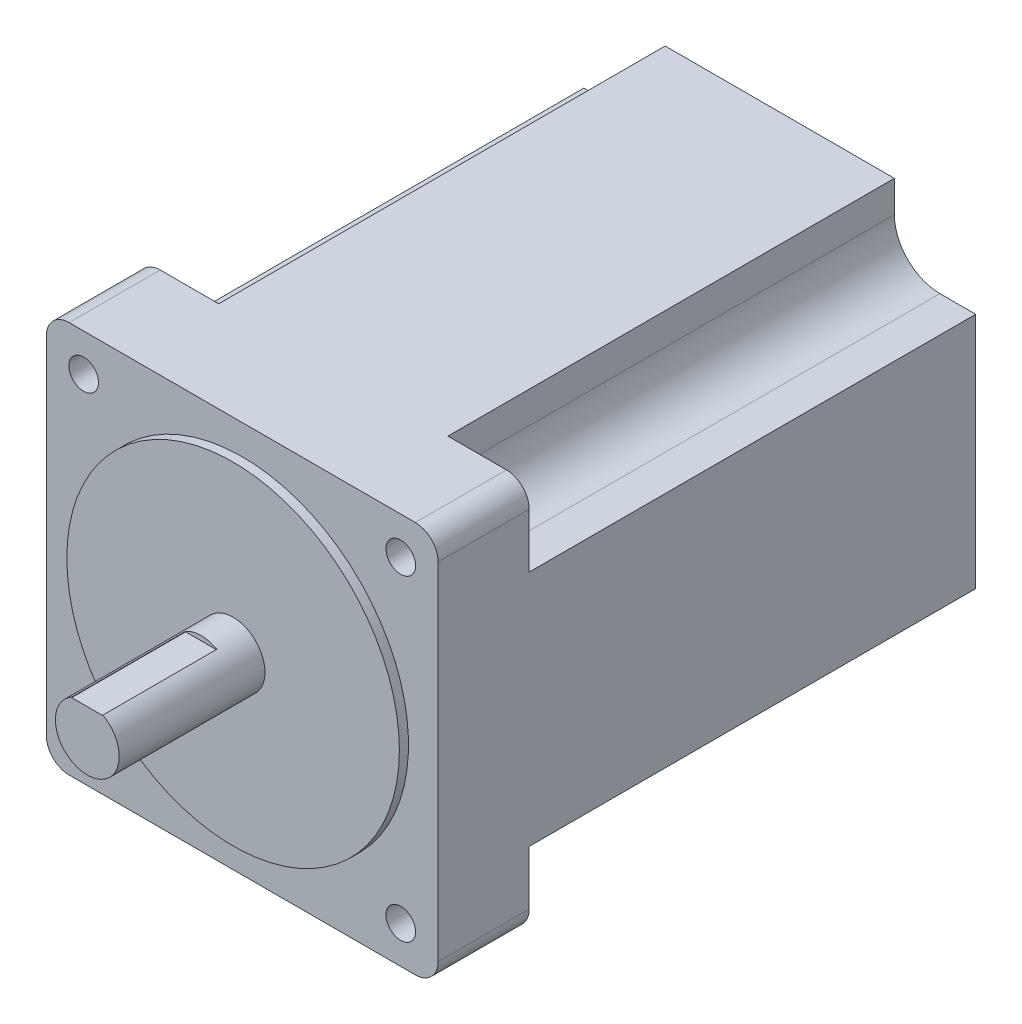
ISO-10303-21;
HEADER;
FILE_DESCRIPTION(('STEP AP214'),'2;1');
FILE_NAME('part.step','',(''),(''),'','','');
FILE_SCHEMA(('AUTOMOTIVE_DESIGN { 1 0 10303 214 1 1 1 1 }'));
ENDSEC;
DATA;
#1=APPLICATION_CONTEXT('core data for automotive mechanical design processes');
#2=APPLICATION_PROTOCOL_DEFINITION('international standard','automotive_design',2000,#1);
#3=PRODUCT_CONTEXT('',#1,'mechanical');
#4=PRODUCT('Part','Part','',(#3));
#5=PRODUCT_RELATED_PRODUCT_CATEGORY('part','',(#4));
#6=PRODUCT_DEFINITION_FORMATION('','',#4);
#7=PRODUCT_DEFINITION_CONTEXT('part definition',#1,'design');
#8=PRODUCT_DEFINITION('design','',#6,#7);
#9=PRODUCT_DEFINITION_SHAPE('','',#8);
#10=(LENGTH_UNIT() NAMED_UNIT(*) SI_UNIT(.MILLI.,.METRE.));
#11=(NAMED_UNIT(*) PLANE_ANGLE_UNIT() SI_UNIT($,.RADIAN.));
#12=(NAMED_UNIT(*) SI_UNIT($,.STERADIAN.) SOLID_ANGLE_UNIT());
#13=UNCERTAINTY_MEASURE_WITH_UNIT(LENGTH_MEASURE(1.E-05),#10,'distance_accuracy_value','');
#14=(GEOMETRIC_REPRESENTATION_CONTEXT(3) GLOBAL_UNCERTAINTY_ASSIGNED_CONTEXT((#13)) GLOBAL_UNIT_ASSIGNED_CONTEXT((#10,
#11,#12)) REPRESENTATION_CONTEXT('',''));
#15=CARTESIAN_POINT('',(0.,0.,0.));
#16=DIRECTION('',(0.,0.,1.));
#17=DIRECTION('',(1.,0.,0.));
#18=AXIS2_PLACEMENT_3D('',#15,#16,#17);
#19=CARTESIAN_POINT('',(5.,5.,118.));
#20=DIRECTION('',(0.,0.,-1.));
#21=DIRECTION('',(-1.,0.,0.));
#22=AXIS2_PLACEMENT_3D('',#19,#20,#21);
#23=CYLINDRICAL_SURFACE('',#22,5.);
#24=DIRECTION('',(0.,0.,-1.));
#25=VECTOR('',#24,1.);
#26=CARTESIAN_POINT('',(0.,5.,118.));
#27=LINE('',#26,#25);
#28=CARTESIAN_POINT('',(0.,5.,98.));
#29=VERTEX_POINT('',#28);
#30=CARTESIAN_POINT('',(0.,5.,118.));
#31=VERTEX_POINT('',#30);
#32=EDGE_CURVE('E446',#29,#31,#27,.F.);
#33=ORIENTED_EDGE('',*,*,#32,.F.);
#34=CARTESIAN_POINT('',(5.,5.,98.));
#35=DIRECTION('',(0.,0.,-1.));
#36=DIRECTION('',(-1.,0.,0.));
#37=AXIS2_PLACEMENT_3D('',#34,#35,#36);
#38=CIRCLE('',#37,5.);
#39=CARTESIAN_POINT('',(5.,0.,98.));
#40=VERTEX_POINT('',#39);
#41=EDGE_CURVE('E310',#29,#40,#38,.F.);
#42=ORIENTED_EDGE('',*,*,#41,.T.);
#43=DIRECTION('',(0.,0.,-1.));
#44=VECTOR('',#43,1.);
#45=CARTESIAN_POINT('',(5.,0.,118.));
#46=LINE('',#45,#44);
#47=CARTESIAN_POINT('',(5.,0.,118.));
#48=VERTEX_POINT('',#47);
#49=EDGE_CURVE('E430',#48,#40,#46,.T.);
#50=ORIENTED_EDGE('',*,*,#49,.F.);
#51=CARTESIAN_POINT('',(5.,5.,118.));
#52=DIRECTION('',(0.,0.,-1.));
#53=DIRECTION('',(-1.,0.,0.));
#54=AXIS2_PLACEMENT_3D('',#51,#52,#53);
#55=CIRCLE('',#54,5.);
#56=EDGE_CURVE('E439',#31,#48,#55,.F.);
#57=ORIENTED_EDGE('',*,*,#56,.F.);
#58=EDGE_LOOP('',(#33,#42,#50,#57));
#59=FACE_BOUND('',#58,.T.);
#60=ADVANCED_FACE('F35',(#59),#23,.T.);
#61=CARTESIAN_POINT('',(8.19999999999998,8.2,0.));
#62=DIRECTION('',(0.,0.,1.));
#63=DIRECTION('',(1.,0.,0.));
#64=AXIS2_PLACEMENT_3D('',#61,#62,#63);
#65=CYLINDRICAL_SURFACE('',#64,3.25);
#66=CARTESIAN_POINT('',(8.19999999999998,8.2,118.));
#67=DIRECTION('',(0.,0.,1.));
#68=DIRECTION('',(-1.,0.,0.));
#69=AXIS2_PLACEMENT_3D('',#66,#67,#68);
#70=CIRCLE('',#69,3.25);
#71=CARTESIAN_POINT('',(4.94999999999998,8.2,118.));
#72=VERTEX_POINT('',#71);
#73=EDGE_CURVE('E360',#72,#72,#70,.T.);
#74=ORIENTED_EDGE('',*,*,#73,.T.);
#75=EDGE_LOOP('',(#74));
#76=FACE_BOUND('',#75,.T.);
#77=CARTESIAN_POINT('',(8.19999999999998,8.2,98.));
#78=DIRECTION('',(0.,0.,-1.));
#79=DIRECTION('',(-1.,0.,0.));
#80=AXIS2_PLACEMENT_3D('',#77,#78,#79);
#81=CIRCLE('',#80,3.25);
#82=CARTESIAN_POINT('',(4.94999999999998,8.2,98.));
#83=VERTEX_POINT('',#82);
#84=EDGE_CURVE('E309',#83,#83,#81,.F.);
#85=ORIENTED_EDGE('',*,*,#84,.F.);
#86=EDGE_LOOP('',(#85));
#87=FACE_BOUND('',#86,.T.);
#88=ADVANCED_FACE('F466',(#76,#87),#65,.F.);
#89=CARTESIAN_POINT('',(81.,81.,118.));
#90=DIRECTION('',(0.,0.,-1.));
#91=DIRECTION('',(-1.,0.,0.));
#92=AXIS2_PLACEMENT_3D('',#89,#90,#91);
#93=CYLINDRICAL_SURFACE('',#92,5.);
#94=DIRECTION('',(0.,0.,-1.));
#95=VECTOR('',#94,1.);
#96=CARTESIAN_POINT('',(86.,81.,118.));
#97=LINE('',#96,#95);
#98=CARTESIAN_POINT('',(86.,81.,98.));
#99=VERTEX_POINT('',#98);
#100=CARTESIAN_POINT('',(86.,81.,118.));
#101=VERTEX_POINT('',#100);
#102=EDGE_CURVE('E417',#99,#101,#97,.F.);
#103=ORIENTED_EDGE('',*,*,#102,.F.);
#104=CARTESIAN_POINT('',(81.,81.,98.));
#105=DIRECTION('',(0.,0.,-1.));
#106=DIRECTION('',(-1.,0.,0.));
#107=AXIS2_PLACEMENT_3D('',#104,#105,#106);
#108=CIRCLE('',#107,5.);
#109=CARTESIAN_POINT('',(81.,86.,98.));
#110=VERTEX_POINT('',#109);
#111=EDGE_CURVE('E352',#99,#110,#108,.F.);
#112=ORIENTED_EDGE('',*,*,#111,.T.);
#113=DIRECTION('',(0.,0.,-1.));
#114=VECTOR('',#113,1.);
#115=CARTESIAN_POINT('',(81.,86.,118.));
#116=LINE('',#115,#114);
#117=CARTESIAN_POINT('',(81.,86.,118.));
#118=VERTEX_POINT('',#117);
#119=EDGE_CURVE('E448',#118,#110,#116,.T.);
#120=ORIENTED_EDGE('',*,*,#119,.F.);
#121=CARTESIAN_POINT('',(81.,81.,118.));
#122=DIRECTION('',(0.,0.,-1.));
#123=DIRECTION('',(-1.,0.,0.));
#124=AXIS2_PLACEMENT_3D('',#121,#122,#123);
#125=CIRCLE('',#124,5.);
#126=EDGE_CURVE('E435',#101,#118,#125,.F.);
#127=ORIENTED_EDGE('',*,*,#126,.F.);
#128=EDGE_LOOP('',(#103,#112,#120,#127));
#129=FACE_BOUND('',#128,.T.);
#130=ADVANCED_FACE('F37',(#129),#93,.T.);
#131=CARTESIAN_POINT('',(77.8,77.8,0.));
#132=DIRECTION('',(0.,0.,1.));
#133=DIRECTION('',(1.,0.,0.));
#134=AXIS2_PLACEMENT_3D('',#131,#132,#133);
#135=CYLINDRICAL_SURFACE('',#134,3.24999999999999);
#136=CARTESIAN_POINT('',(77.8,77.8,118.));
#137=DIRECTION('',(0.,0.,1.));
#138=DIRECTION('',(-1.,0.,0.));
#139=AXIS2_PLACEMENT_3D('',#136,#137,#138);
#140=CIRCLE('',#139,3.24999999999999);
#141=CARTESIAN_POINT('',(74.55,77.8,118.));
#142=VERTEX_POINT('',#141);
#143=EDGE_CURVE('E361',#142,#142,#140,.T.);
#144=ORIENTED_EDGE('',*,*,#143,.T.);
#145=EDGE_LOOP('',(#144));
#146=FACE_BOUND('',#145,.T.);
#147=CARTESIAN_POINT('',(77.8,77.8,98.));
#148=DIRECTION('',(0.,0.,-1.));
#149=DIRECTION('',(-1.,0.,0.));
#150=AXIS2_PLACEMENT_3D('',#147,#148,#149);
#151=CIRCLE('',#150,3.24999999999999);
#152=CARTESIAN_POINT('',(74.55,77.8,98.));
#153=VERTEX_POINT('',#152);
#154=EDGE_CURVE('E347',#153,#153,#151,.F.);
#155=ORIENTED_EDGE('',*,*,#154,.F.);
#156=EDGE_LOOP('',(#155));
#157=FACE_BOUND('',#156,.T.);
#158=ADVANCED_FACE('F474',(#146,#157),#135,.F.);
#159=CARTESIAN_POINT('',(0.,0.,118.));
#160=DIRECTION('',(1.,0.,0.));
#161=DIRECTION('',(0.,1.,0.));
#162=AXIS2_PLACEMENT_3D('',#159,#160,#161);
#163=PLANE('',#162);
#164=DIRECTION('',(0.,-1.,0.));
#165=VECTOR('',#164,1.);
#166=CARTESIAN_POINT('',(0.,0.,98.));
#167=LINE('',#166,#165);
#168=CARTESIAN_POINT('',(0.,81.,98.));
#169=VERTEX_POINT('',#168);
#170=CARTESIAN_POINT('',(0.,69.0775879691428,98.));
#171=VERTEX_POINT('',#170);
#172=EDGE_CURVE('E315',#169,#171,#167,.T.);
#173=ORIENTED_EDGE('',*,*,#172,.T.);
#174=DIRECTION('',(0.,0.,-1.));
#175=VECTOR('',#174,1.);
#176=CARTESIAN_POINT('',(0.,69.0775879691428,118.));
#177=LINE('',#176,#175);
#178=CARTESIAN_POINT('',(0.,69.0775879691428,0.));
#179=VERTEX_POINT('',#178);
#180=EDGE_CURVE('E324',#171,#179,#177,.T.);
#181=ORIENTED_EDGE('',*,*,#180,.T.);
#182=DIRECTION('',(0.,-1.,0.));
#183=VECTOR('',#182,1.);
#184=CARTESIAN_POINT('',(0.,0.,0.));
#185=LINE('',#184,#183);
#186=CARTESIAN_POINT('',(0.,16.9224120308572,0.));
#187=VERTEX_POINT('',#186);
#188=EDGE_CURVE('E404',#179,#187,#185,.T.);
#189=ORIENTED_EDGE('',*,*,#188,.T.);
#190=DIRECTION('',(0.,0.,1.));
#191=VECTOR('',#190,1.);
#192=CARTESIAN_POINT('',(0.,16.9224120308572,118.));
#193=LINE('',#192,#191);
#194=CARTESIAN_POINT('',(0.,16.9224120308572,98.));
#195=VERTEX_POINT('',#194);
#196=EDGE_CURVE('E321',#187,#195,#193,.T.);
#197=ORIENTED_EDGE('',*,*,#196,.T.);
#198=DIRECTION('',(0.,1.,0.));
#199=VECTOR('',#198,1.);
#200=CARTESIAN_POINT('',(0.,0.,98.));
#201=LINE('',#200,#199);
#202=EDGE_CURVE('E312',#29,#195,#201,.T.);
#203=ORIENTED_EDGE('',*,*,#202,.F.);
#204=ORIENTED_EDGE('',*,*,#32,.T.);
#205=DIRECTION('',(0.,-1.,0.));
#206=VECTOR('',#205,1.);
#207=CARTESIAN_POINT('',(0.,0.,118.));
#208=LINE('',#207,#206);
#209=CARTESIAN_POINT('',(0.,81.,118.));
#210=VERTEX_POINT('',#209);
#211=EDGE_CURVE('E405',#210,#31,#208,.T.);
#212=ORIENTED_EDGE('',*,*,#211,.F.);
#213=DIRECTION('',(0.,0.,-1.));
#214=VECTOR('',#213,1.);
#215=CARTESIAN_POINT('',(0.,81.,118.));
#216=LINE('',#215,#214);
#217=EDGE_CURVE('E443',#210,#169,#216,.T.);
#218=ORIENTED_EDGE('',*,*,#217,.T.);
#219=EDGE_LOOP('',(#173,#181,#189,#197,#203,#204,#212,#218));
#220=FACE_BOUND('',#219,.T.);
#221=ADVANCED_FACE('F537',(#220),#163,.F.);
#222=CARTESIAN_POINT('',(0.,0.,118.));
#223=DIRECTION('',(0.,1.,0.));
#224=DIRECTION('',(0.,0.,1.));
#225=AXIS2_PLACEMENT_3D('',#222,#223,#224);
#226=PLANE('',#225);
#227=DIRECTION('',(-1.,0.,0.));
#228=VECTOR('',#227,1.);
#229=CARTESIAN_POINT('',(17.8434747405845,0.,98.));
#230=LINE('',#229,#228);
#231=CARTESIAN_POINT('',(17.8434747405845,0.,98.));
#232=VERTEX_POINT('',#231);
#233=EDGE_CURVE('E60',#232,#40,#230,.T.);
#234=ORIENTED_EDGE('',*,*,#233,.F.);
#235=DIRECTION('',(0.,0.,-1.));
#236=VECTOR('',#235,1.);
#237=CARTESIAN_POINT('',(17.8434747405845,0.,98.));
#238=LINE('',#237,#236);
#239=CARTESIAN_POINT('',(17.8434747405845,0.,0.));
#240=VERTEX_POINT('',#239);
#241=EDGE_CURVE('E278',#232,#240,#238,.T.);
#242=ORIENTED_EDGE('',*,*,#241,.T.);
#243=DIRECTION('',(1.,0.,0.));
#244=VECTOR('',#243,1.);
#245=CARTESIAN_POINT('',(0.,0.,0.));
#246=LINE('',#245,#244);
#247=CARTESIAN_POINT('',(68.1565252594154,0.,0.));
#248=VERTEX_POINT('',#247);
#249=EDGE_CURVE('E420',#240,#248,#246,.T.);
#250=ORIENTED_EDGE('',*,*,#249,.T.);
#251=DIRECTION('',(0.,0.,-1.));
#252=VECTOR('',#251,1.);
#253=CARTESIAN_POINT('',(68.1565252594154,0.,98.));
#254=LINE('',#253,#252);
#255=CARTESIAN_POINT('',(68.1565252594154,0.,98.));
#256=VERTEX_POINT('',#255);
#257=EDGE_CURVE('E302',#256,#248,#254,.T.);
#258=ORIENTED_EDGE('',*,*,#257,.F.);
#259=DIRECTION('',(-1.,0.,0.));
#260=VECTOR('',#259,1.);
#261=CARTESIAN_POINT('',(68.1565252594154,0.,98.));
#262=LINE('',#261,#260);
#263=CARTESIAN_POINT('',(81.,0.,98.));
#264=VERTEX_POINT('',#263);
#265=EDGE_CURVE('E288',#264,#256,#262,.T.);
#266=ORIENTED_EDGE('',*,*,#265,.F.);
#267=DIRECTION('',(0.,0.,-1.));
#268=VECTOR('',#267,1.);
#269=CARTESIAN_POINT('',(81.,0.,118.));
#270=LINE('',#269,#268);
#271=CARTESIAN_POINT('',(81.,0.,118.));
#272=VERTEX_POINT('',#271);
#273=EDGE_CURVE('E433',#264,#272,#270,.F.);
#274=ORIENTED_EDGE('',*,*,#273,.T.);
#275=DIRECTION('',(1.,0.,0.));
#276=VECTOR('',#275,1.);
#277=CARTESIAN_POINT('',(0.,0.,118.));
#278=LINE('',#277,#276);
#279=EDGE_CURVE('E408',#48,#272,#278,.T.);
#280=ORIENTED_EDGE('',*,*,#279,.F.);
#281=ORIENTED_EDGE('',*,*,#49,.T.);
#282=EDGE_LOOP('',(#234,#242,#250,#258,#266,#274,#280,#281));
#283=FACE_BOUND('',#282,.T.);
#284=ADVANCED_FACE('F533',(#283),#226,.F.);
#285=CARTESIAN_POINT('',(86.,0.,118.));
#286=DIRECTION('',(-1.,0.,0.));
#287=DIRECTION('',(0.,-1.,0.));
#288=AXIS2_PLACEMENT_3D('',#285,#286,#287);
#289=PLANE('',#288);
#290=DIRECTION('',(0.,1.,0.));
#291=VECTOR('',#290,1.);
#292=CARTESIAN_POINT('',(86.,0.,98.));
#293=LINE('',#292,#291);
#294=CARTESIAN_POINT('',(86.,5.,98.));
#295=VERTEX_POINT('',#294);
#296=CARTESIAN_POINT('',(86.,16.9224120308571,98.));
#297=VERTEX_POINT('',#296);
#298=EDGE_CURVE('E52',#295,#297,#293,.T.);
#299=ORIENTED_EDGE('',*,*,#298,.T.);
#300=DIRECTION('',(0.,0.,-1.));
#301=VECTOR('',#300,1.);
#302=CARTESIAN_POINT('',(86.,16.9224120308571,118.));
#303=LINE('',#302,#301);
#304=CARTESIAN_POINT('',(86.,16.9224120308571,0.));
#305=VERTEX_POINT('',#304);
#306=EDGE_CURVE('E318',#297,#305,#303,.T.);
#307=ORIENTED_EDGE('',*,*,#306,.T.);
#308=DIRECTION('',(0.,1.,0.));
#309=VECTOR('',#308,1.);
#310=CARTESIAN_POINT('',(86.,0.,0.));
#311=LINE('',#310,#309);
#312=CARTESIAN_POINT('',(86.,69.0775879691428,0.));
#313=VERTEX_POINT('',#312);
#314=EDGE_CURVE('E423',#305,#313,#311,.T.);
#315=ORIENTED_EDGE('',*,*,#314,.T.);
#316=DIRECTION('',(0.,0.,1.));
#317=VECTOR('',#316,1.);
#318=CARTESIAN_POINT('',(86.,69.0775879691428,118.));
#319=LINE('',#318,#317);
#320=CARTESIAN_POINT('',(86.,69.0775879691428,98.));
#321=VERTEX_POINT('',#320);
#322=EDGE_CURVE('E357',#313,#321,#319,.T.);
#323=ORIENTED_EDGE('',*,*,#322,.T.);
#324=DIRECTION('',(0.,-1.,0.));
#325=VECTOR('',#324,1.);
#326=CARTESIAN_POINT('',(86.,0.,98.));
#327=LINE('',#326,#325);
#328=EDGE_CURVE('E355',#99,#321,#327,.T.);
#329=ORIENTED_EDGE('',*,*,#328,.F.);
#330=ORIENTED_EDGE('',*,*,#102,.T.);
#331=DIRECTION('',(0.,1.,0.));
#332=VECTOR('',#331,1.);
#333=CARTESIAN_POINT('',(86.,0.,118.));
#334=LINE('',#333,#332);
#335=CARTESIAN_POINT('',(86.,5.,118.));
#336=VERTEX_POINT('',#335);
#337=EDGE_CURVE('E411',#336,#101,#334,.T.);
#338=ORIENTED_EDGE('',*,*,#337,.F.);
#339=DIRECTION('',(0.,0.,-1.));
#340=VECTOR('',#339,1.);
#341=CARTESIAN_POINT('',(86.,5.,118.));
#342=LINE('',#341,#340);
#343=EDGE_CURVE('E427',#336,#295,#342,.T.);
#344=ORIENTED_EDGE('',*,*,#343,.T.);
#345=EDGE_LOOP('',(#299,#307,#315,#323,#329,#330,#338,#344));
#346=FACE_BOUND('',#345,.T.);
#347=ADVANCED_FACE('F530',(#346),#289,.F.);
#348=CARTESIAN_POINT('',(0.,86.,118.));
#349=DIRECTION('',(0.,-1.,0.));
#350=DIRECTION('',(0.,0.,-1.));
#351=AXIS2_PLACEMENT_3D('',#348,#349,#350);
#352=PLANE('',#351);
#353=DIRECTION('',(-1.,0.,0.));
#354=VECTOR('',#353,1.);
#355=CARTESIAN_POINT('',(0.,86.,0.));
#356=LINE('',#355,#354);
#357=CARTESIAN_POINT('',(68.1565252594154,86.,0.));
#358=VERTEX_POINT('',#357);
#359=CARTESIAN_POINT('',(17.8434747405845,86.,0.));
#360=VERTEX_POINT('',#359);
#361=EDGE_CURVE('E248',#358,#360,#356,.T.);
#362=ORIENTED_EDGE('',*,*,#361,.T.);
#363=DIRECTION('',(0.,0.,-1.));
#364=VECTOR('',#363,1.);
#365=CARTESIAN_POINT('',(17.8434747405845,86.,98.));
#366=LINE('',#365,#364);
#367=CARTESIAN_POINT('',(17.8434747405845,86.,98.));
#368=VERTEX_POINT('',#367);
#369=EDGE_CURVE('E238',#368,#360,#366,.T.);
#370=ORIENTED_EDGE('',*,*,#369,.F.);
#371=DIRECTION('',(1.,0.,0.));
#372=VECTOR('',#371,1.);
#373=CARTESIAN_POINT('',(17.8434747405845,86.,98.));
#374=LINE('',#373,#372);
#375=CARTESIAN_POINT('',(4.99999999999997,86.,98.));
#376=VERTEX_POINT('',#375);
#377=EDGE_CURVE('E223',#376,#368,#374,.T.);
#378=ORIENTED_EDGE('',*,*,#377,.F.);
#379=DIRECTION('',(0.,0.,-1.));
#380=VECTOR('',#379,1.);
#381=CARTESIAN_POINT('',(4.99999999999997,86.,118.));
#382=LINE('',#381,#380);
#383=CARTESIAN_POINT('',(4.99999999999997,86.,118.));
#384=VERTEX_POINT('',#383);
#385=EDGE_CURVE('E451',#376,#384,#382,.F.);
#386=ORIENTED_EDGE('',*,*,#385,.T.);
#387=DIRECTION('',(-1.,0.,0.));
#388=VECTOR('',#387,1.);
#389=CARTESIAN_POINT('',(0.,86.,118.));
#390=LINE('',#389,#388);
#391=EDGE_CURVE('E414',#118,#384,#390,.T.);
#392=ORIENTED_EDGE('',*,*,#391,.F.);
#393=ORIENTED_EDGE('',*,*,#119,.T.);
#394=DIRECTION('',(1.,0.,0.));
#395=VECTOR('',#394,1.);
#396=CARTESIAN_POINT('',(68.1565252594154,86.,98.));
#397=LINE('',#396,#395);
#398=CARTESIAN_POINT('',(68.1565252594154,86.,98.));
#399=VERTEX_POINT('',#398);
#400=EDGE_CURVE('E331',#399,#110,#397,.T.);
#401=ORIENTED_EDGE('',*,*,#400,.F.);
#402=DIRECTION('',(0.,0.,-1.));
#403=VECTOR('',#402,1.);
#404=CARTESIAN_POINT('',(68.1565252594154,86.,98.));
#405=LINE('',#404,#403);
#406=EDGE_CURVE('E339',#399,#358,#405,.T.);
#407=ORIENTED_EDGE('',*,*,#406,.T.);
#408=EDGE_LOOP('',(#362,#370,#378,#386,#392,#393,#401,#407));
#409=FACE_BOUND('',#408,.T.);
#410=ADVANCED_FACE('F245',(#409),#352,.F.);
#411=CARTESIAN_POINT('',(0.,0.,118.));
#412=DIRECTION('',(0.,0.,-1.));
#413=DIRECTION('',(-1.,0.,0.));
#414=AXIS2_PLACEMENT_3D('',#411,#412,#413);
#415=PLANE('',#414);
#416=ORIENTED_EDGE('',*,*,#143,.F.);
#417=EDGE_LOOP('',(#416));
#418=FACE_BOUND('',#417,.T.);
#419=CARTESIAN_POINT('',(77.8,8.20000000000001,118.));
#420=DIRECTION('',(0.,0.,1.));
#421=DIRECTION('',(1.,0.,0.));
#422=AXIS2_PLACEMENT_3D('',#419,#420,#421);
#423=CIRCLE('',#422,3.24999999999999);
#424=CARTESIAN_POINT('',(81.05,8.20000000000001,118.));
#425=VERTEX_POINT('',#424);
#426=EDGE_CURVE('E365',#425,#425,#423,.T.);
#427=ORIENTED_EDGE('',*,*,#426,.F.);
#428=EDGE_LOOP('',(#427));
#429=FACE_BOUND('',#428,.T.);
#430=ORIENTED_EDGE('',*,*,#73,.F.);
#431=EDGE_LOOP('',(#430));
#432=FACE_BOUND('',#431,.T.);
#433=CARTESIAN_POINT('',(8.19999999999997,77.8,118.));
#434=DIRECTION('',(0.,0.,1.));
#435=DIRECTION('',(1.,0.,0.));
#436=AXIS2_PLACEMENT_3D('',#433,#434,#435);
#437=CIRCLE('',#436,3.25);
#438=CARTESIAN_POINT('',(11.45,77.8,118.));
#439=VERTEX_POINT('',#438);
#440=EDGE_CURVE('E364',#439,#439,#437,.T.);
#441=ORIENTED_EDGE('',*,*,#440,.F.);
#442=EDGE_LOOP('',(#441));
#443=FACE_BOUND('',#442,.T.);
#444=CARTESIAN_POINT('',(43.,43.,118.));
#445=DIRECTION('',(0.,0.,-1.));
#446=DIRECTION('',(-1.,0.,0.));
#447=AXIS2_PLACEMENT_3D('',#444,#445,#446);
#448=CIRCLE('',#447,36.5);
#449=CARTESIAN_POINT('',(6.49999999999997,43.,118.));
#450=VERTEX_POINT('',#449);
#451=EDGE_CURVE('E453',#450,#450,#448,.F.);
#452=ORIENTED_EDGE('',*,*,#451,.F.);
#453=EDGE_LOOP('',(#452));
#454=FACE_BOUND('',#453,.T.);
#455=ORIENTED_EDGE('',*,*,#279,.T.);
#456=CARTESIAN_POINT('',(81.,5.,118.));
#457=DIRECTION('',(0.,0.,-1.));
#458=DIRECTION('',(-1.,0.,0.));
#459=AXIS2_PLACEMENT_3D('',#456,#457,#458);
#460=CIRCLE('',#459,5.);
#461=EDGE_CURVE('E441',#272,#336,#460,.F.);
#462=ORIENTED_EDGE('',*,*,#461,.T.);
#463=ORIENTED_EDGE('',*,*,#337,.T.);
#464=ORIENTED_EDGE('',*,*,#126,.T.);
#465=ORIENTED_EDGE('',*,*,#391,.T.);
#466=CARTESIAN_POINT('',(4.99999999999997,81.,118.));
#467=DIRECTION('',(0.,0.,-1.));
#468=DIRECTION('',(-1.,0.,0.));
#469=AXIS2_PLACEMENT_3D('',#466,#467,#468);
#470=CIRCLE('',#469,5.);
#471=EDGE_CURVE('E437',#384,#210,#470,.F.);
#472=ORIENTED_EDGE('',*,*,#471,.T.);
#473=ORIENTED_EDGE('',*,*,#211,.T.);
#474=ORIENTED_EDGE('',*,*,#56,.T.);
#475=EDGE_LOOP('',(#455,#462,#463,#464,#465,#472,#473,#474));
#476=FACE_BOUND('',#475,.T.);
#477=ADVANCED_FACE('F519',(#418,#429,#432,#443,#454,#476),#415,.F.);
#478=CARTESIAN_POINT('',(0.,0.,0.));
#479=DIRECTION('',(0.,0.,-1.));
#480=DIRECTION('',(-1.,0.,0.));
#481=AXIS2_PLACEMENT_3D('',#478,#479,#480);
#482=PLANE('',#481);
#483=DIRECTION('',(-1.,0.,0.));
#484=VECTOR('',#483,1.);
#485=CARTESIAN_POINT('',(7.84347474058446,69.0775879691428,0.));
#486=LINE('',#485,#484);
#487=CARTESIAN_POINT('',(7.84347474058445,69.0775879691428,0.));
#488=VERTEX_POINT('',#487);
#489=EDGE_CURVE('E233',#488,#179,#486,.T.);
#490=ORIENTED_EDGE('',*,*,#489,.F.);
#491=CARTESIAN_POINT('',(7.84347474058453,79.0775879691428,0.));
#492=DIRECTION('',(0.,0.,-1.));
#493=DIRECTION('',(1.,0.,0.));
#494=AXIS2_PLACEMENT_3D('',#491,#492,#493);
#495=CIRCLE('',#494,9.99999999999999);
#496=CARTESIAN_POINT('',(17.8434747405845,79.0775879691429,0.));
#497=VERTEX_POINT('',#496);
#498=EDGE_CURVE('E580',#497,#488,#495,.T.);
#499=ORIENTED_EDGE('',*,*,#498,.F.);
#500=DIRECTION('',(0.,-1.,0.));
#501=VECTOR('',#500,1.);
#502=CARTESIAN_POINT('',(17.8434747405845,86.,0.));
#503=LINE('',#502,#501);
#504=EDGE_CURVE('E277',#360,#497,#503,.T.);
#505=ORIENTED_EDGE('',*,*,#504,.F.);
#506=ORIENTED_EDGE('',*,*,#361,.F.);
#507=DIRECTION('',(0.,1.,0.));
#508=VECTOR('',#507,1.);
#509=CARTESIAN_POINT('',(68.1565252594154,86.,0.));
#510=LINE('',#509,#508);
#511=CARTESIAN_POINT('',(68.1565252594154,79.0775879691428,0.));
#512=VERTEX_POINT('',#511);
#513=EDGE_CURVE('E327',#512,#358,#510,.T.);
#514=ORIENTED_EDGE('',*,*,#513,.F.);
#515=CARTESIAN_POINT('',(78.1565252594154,79.0775879691428,0.));
#516=DIRECTION('',(0.,0.,-1.));
#517=DIRECTION('',(-1.,0.,0.));
#518=AXIS2_PLACEMENT_3D('',#515,#516,#517);
#519=CIRCLE('',#518,9.99999999999999);
#520=CARTESIAN_POINT('',(78.1565252594155,69.0775879691428,0.));
#521=VERTEX_POINT('',#520);
#522=EDGE_CURVE('E332',#521,#512,#519,.T.);
#523=ORIENTED_EDGE('',*,*,#522,.F.);
#524=DIRECTION('',(-1.,0.,0.));
#525=VECTOR('',#524,1.);
#526=CARTESIAN_POINT('',(78.1565252594155,69.0775879691428,0.));
#527=LINE('',#526,#525);
#528=EDGE_CURVE('E341',#313,#521,#527,.T.);
#529=ORIENTED_EDGE('',*,*,#528,.F.);
#530=ORIENTED_EDGE('',*,*,#314,.F.);
#531=DIRECTION('',(1.,0.,0.));
#532=VECTOR('',#531,1.);
#533=CARTESIAN_POINT('',(78.1565252594155,16.9224120308571,0.));
#534=LINE('',#533,#532);
#535=CARTESIAN_POINT('',(78.1565252594155,16.9224120308571,0.));
#536=VERTEX_POINT('',#535);
#537=EDGE_CURVE('E297',#536,#305,#534,.T.);
#538=ORIENTED_EDGE('',*,*,#537,.F.);
#539=CARTESIAN_POINT('',(78.1565252594154,6.92241203085715,0.));
#540=DIRECTION('',(0.,0.,-1.));
#541=DIRECTION('',(1.,0.,0.));
#542=AXIS2_PLACEMENT_3D('',#539,#540,#541);
#543=CIRCLE('',#542,9.99999999999999);
#544=CARTESIAN_POINT('',(68.1565252594154,6.92241203085708,0.));
#545=VERTEX_POINT('',#544);
#546=EDGE_CURVE('E294',#545,#536,#543,.T.);
#547=ORIENTED_EDGE('',*,*,#546,.F.);
#548=DIRECTION('',(0.,1.,0.));
#549=VECTOR('',#548,1.);
#550=CARTESIAN_POINT('',(68.1565252594154,0.,0.));
#551=LINE('',#550,#549);
#552=EDGE_CURVE('E286',#248,#545,#551,.T.);
#553=ORIENTED_EDGE('',*,*,#552,.F.);
#554=ORIENTED_EDGE('',*,*,#249,.F.);
#555=DIRECTION('',(0.,-1.,0.));
#556=VECTOR('',#555,1.);
#557=CARTESIAN_POINT('',(17.8434747405845,0.,0.));
#558=LINE('',#557,#556);
#559=CARTESIAN_POINT('',(17.8434747405845,6.9224120308571,0.));
#560=VERTEX_POINT('',#559);
#561=EDGE_CURVE('E270',#560,#240,#558,.T.);
#562=ORIENTED_EDGE('',*,*,#561,.F.);
#563=CARTESIAN_POINT('',(7.84347474058453,6.92241203085717,0.));
#564=DIRECTION('',(0.,0.,-1.));
#565=DIRECTION('',(-1.,0.,0.));
#566=AXIS2_PLACEMENT_3D('',#563,#564,#565);
#567=CIRCLE('',#566,9.99999999999999);
#568=CARTESIAN_POINT('',(7.84347474058446,16.9224120308572,0.));
#569=VERTEX_POINT('',#568);
#570=EDGE_CURVE('E267',#569,#560,#567,.T.);
#571=ORIENTED_EDGE('',*,*,#570,.F.);
#572=DIRECTION('',(1.,0.,0.));
#573=VECTOR('',#572,1.);
#574=CARTESIAN_POINT('',(7.84347474058446,16.9224120308572,0.));
#575=LINE('',#574,#573);
#576=EDGE_CURVE('E261',#187,#569,#575,.T.);
#577=ORIENTED_EDGE('',*,*,#576,.F.);
#578=ORIENTED_EDGE('',*,*,#188,.F.);
#579=EDGE_LOOP('',(#490,#499,#505,#506,#514,#523,#529,#530,#538,#547,#553,#554,#562,#571,#577,#578));
#580=FACE_BOUND('',#579,.T.);
#581=ADVANCED_FACE('F522',(#580),#482,.T.);
#582=CARTESIAN_POINT('',(81.,5.,118.));
#583=DIRECTION('',(0.,0.,-1.));
#584=DIRECTION('',(-1.,0.,0.));
#585=AXIS2_PLACEMENT_3D('',#582,#583,#584);
#586=CYLINDRICAL_SURFACE('',#585,5.);
#587=CARTESIAN_POINT('',(81.,5.,98.));
#588=DIRECTION('',(0.,0.,1.));
#589=DIRECTION('',(1.,0.,0.));
#590=AXIS2_PLACEMENT_3D('',#587,#588,#589);
#591=CIRCLE('',#590,5.);
#592=EDGE_CURVE('E305',#295,#264,#591,.F.);
#593=ORIENTED_EDGE('',*,*,#592,.F.);
#594=ORIENTED_EDGE('',*,*,#343,.F.);
#595=ORIENTED_EDGE('',*,*,#461,.F.);
#596=ORIENTED_EDGE('',*,*,#273,.F.);
#597=EDGE_LOOP('',(#593,#594,#595,#596));
#598=FACE_BOUND('',#597,.T.);
#599=ADVANCED_FACE('F526',(#598),#586,.T.);
#600=CARTESIAN_POINT('',(4.99999999999997,81.,118.));
#601=DIRECTION('',(0.,0.,-1.));
#602=DIRECTION('',(-1.,0.,0.));
#603=AXIS2_PLACEMENT_3D('',#600,#601,#602);
#604=CYLINDRICAL_SURFACE('',#603,5.);
#605=CARTESIAN_POINT('',(4.99999999999997,81.,98.));
#606=DIRECTION('',(0.,0.,1.));
#607=DIRECTION('',(1.,0.,0.));
#608=AXIS2_PLACEMENT_3D('',#605,#606,#607);
#609=CIRCLE('',#608,5.);
#610=EDGE_CURVE('E229',#169,#376,#609,.F.);
#611=ORIENTED_EDGE('',*,*,#610,.F.);
#612=ORIENTED_EDGE('',*,*,#217,.F.);
#613=ORIENTED_EDGE('',*,*,#471,.F.);
#614=ORIENTED_EDGE('',*,*,#385,.F.);
#615=EDGE_LOOP('',(#611,#612,#613,#614));
#616=FACE_BOUND('',#615,.T.);
#617=ADVANCED_FACE('F517',(#616),#604,.T.);
#618=CARTESIAN_POINT('',(43.,43.,120.));
#619=DIRECTION('',(0.,0.,-1.));
#620=DIRECTION('',(-1.,0.,0.));
#621=AXIS2_PLACEMENT_3D('',#618,#619,#620);
#622=CYLINDRICAL_SURFACE('',#621,36.5);
#623=CARTESIAN_POINT('',(43.,43.,120.));
#624=DIRECTION('',(0.,0.,1.));
#625=DIRECTION('',(1.,0.,0.));
#626=AXIS2_PLACEMENT_3D('',#623,#624,#625);
#627=CIRCLE('',#626,36.5);
#628=CARTESIAN_POINT('',(79.5,43.,120.));
#629=VERTEX_POINT('',#628);
#630=EDGE_CURVE('E399',#629,#629,#627,.T.);
#631=ORIENTED_EDGE('',*,*,#630,.F.);
#632=EDGE_LOOP('',(#631));
#633=FACE_BOUND('',#632,.T.);
#634=ORIENTED_EDGE('',*,*,#451,.T.);
#635=EDGE_LOOP('',(#634));
#636=FACE_BOUND('',#635,.T.);
#637=ADVANCED_FACE('F513',(#633,#636),#622,.T.);
#638=CARTESIAN_POINT('',(43.,43.,120.));
#639=DIRECTION('',(0.,0.,1.));
#640=DIRECTION('',(1.,0.,0.));
#641=AXIS2_PLACEMENT_3D('',#638,#639,#640);
#642=PLANE('',#641);
#643=CARTESIAN_POINT('',(43.,43.,120.));
#644=DIRECTION('',(0.,0.,1.));
#645=DIRECTION('',(1.,0.,0.));
#646=AXIS2_PLACEMENT_3D('',#643,#644,#645);
#647=CIRCLE('',#646,7.);
#648=CARTESIAN_POINT('',(50.,43.,120.));
#649=VERTEX_POINT('',#648);
#650=EDGE_CURVE('E395',#649,#649,#647,.T.);
#651=ORIENTED_EDGE('',*,*,#650,.F.);
#652=EDGE_LOOP('',(#651));
#653=FACE_BOUND('',#652,.T.);
#654=ORIENTED_EDGE('',*,*,#630,.T.);
#655=EDGE_LOOP('',(#654));
#656=FACE_BOUND('',#655,.T.);
#657=ADVANCED_FACE('F509',(#653,#656),#642,.T.);
#658=CARTESIAN_POINT('',(43.,43.,152.));
#659=DIRECTION('',(0.,0.,-1.));
#660=DIRECTION('',(-1.,0.,0.));
#661=AXIS2_PLACEMENT_3D('',#658,#659,#660);
#662=CYLINDRICAL_SURFACE('',#661,7.);
#663=CARTESIAN_POINT('',(43.,43.,152.));
#664=DIRECTION('',(0.,0.,1.));
#665=DIRECTION('',(1.,0.,0.));
#666=AXIS2_PLACEMENT_3D('',#663,#664,#665);
#667=CIRCLE('',#666,7.);
#668=CARTESIAN_POINT('',(39.5760440284576,49.1054504751852,152.));
#669=VERTEX_POINT('',#668);
#670=CARTESIAN_POINT('',(46.4239559715424,49.1054504751852,152.));
#671=VERTEX_POINT('',#670);
#672=EDGE_CURVE('E396',#669,#671,#667,.T.);
#673=ORIENTED_EDGE('',*,*,#672,.F.);
#674=DIRECTION('',(0.,0.,-1.));
#675=VECTOR('',#674,1.);
#676=CARTESIAN_POINT('',(39.5760440284576,49.1054504751852,152.));
#677=LINE('',#676,#675);
#678=CARTESIAN_POINT('',(39.5760440284576,49.1054504751852,127.));
#679=VERTEX_POINT('',#678);
#680=EDGE_CURVE('E392',#669,#679,#677,.T.);
#681=ORIENTED_EDGE('',*,*,#680,.T.);
#682=CARTESIAN_POINT('',(43.,43.,127.));
#683=DIRECTION('',(0.,0.,1.));
#684=DIRECTION('',(1.,0.,0.));
#685=AXIS2_PLACEMENT_3D('',#682,#683,#684);
#686=CIRCLE('',#685,7.);
#687=CARTESIAN_POINT('',(46.4239559715424,49.1054504751852,127.));
#688=VERTEX_POINT('',#687);
#689=EDGE_CURVE('E11',#688,#679,#686,.T.);
#690=ORIENTED_EDGE('',*,*,#689,.F.);
#691=DIRECTION('',(0.,0.,-1.));
#692=VECTOR('',#691,1.);
#693=CARTESIAN_POINT('',(46.4239559715424,49.1054504751852,152.));
#694=LINE('',#693,#692);
#695=EDGE_CURVE('E388',#688,#671,#694,.F.);
#696=ORIENTED_EDGE('',*,*,#695,.T.);
#697=EDGE_LOOP('',(#673,#681,#690,#696));
#698=FACE_BOUND('',#697,.T.);
#699=ORIENTED_EDGE('',*,*,#650,.T.);
#700=EDGE_LOOP('',(#699));
#701=FACE_BOUND('',#700,.T.);
#702=ADVANCED_FACE('F505',(#698,#701),#662,.T.);
#703=CARTESIAN_POINT('',(43.,43.,152.));
#704=DIRECTION('',(0.,0.,1.));
#705=DIRECTION('',(1.,0.,0.));
#706=AXIS2_PLACEMENT_3D('',#703,#704,#705);
#707=PLANE('',#706);
#708=DIRECTION('',(0.,-1.,0.));
#709=VECTOR('',#708,1.);
#710=CARTESIAN_POINT('',(39.5760440284576,43.,152.));
#711=LINE('',#710,#709);
#712=CARTESIAN_POINT('',(39.5760440284576,49.,152.));
#713=VERTEX_POINT('',#712);
#714=EDGE_CURVE('E44',#669,#713,#711,.T.);
#715=ORIENTED_EDGE('',*,*,#714,.F.);
#716=ORIENTED_EDGE('',*,*,#672,.T.);
#717=DIRECTION('',(0.,1.,0.));
#718=VECTOR('',#717,1.);
#719=CARTESIAN_POINT('',(46.4239559715424,52.27619479338,152.));
#720=LINE('',#719,#718);
#721=CARTESIAN_POINT('',(46.4239559715424,49.,152.));
#722=VERTEX_POINT('',#721);
#723=EDGE_CURVE('E376',#722,#671,#720,.T.);
#724=ORIENTED_EDGE('',*,*,#723,.F.);
#725=DIRECTION('',(1.,0.,0.));
#726=VECTOR('',#725,1.);
#727=CARTESIAN_POINT('',(39.5760440284576,49.,152.));
#728=LINE('',#727,#726);
#729=EDGE_CURVE('E372',#713,#722,#728,.T.);
#730=ORIENTED_EDGE('',*,*,#729,.F.);
#731=EDGE_LOOP('',(#715,#716,#724,#730));
#732=FACE_BOUND('',#731,.T.);
#733=ADVANCED_FACE('F491',(#732),#707,.T.);
#734=CARTESIAN_POINT('',(0.,0.,127.));
#735=DIRECTION('',(0.,0.,1.));
#736=DIRECTION('',(1.,0.,0.));
#737=AXIS2_PLACEMENT_3D('',#734,#735,#736);
#738=PLANE('',#737);
#739=ORIENTED_EDGE('',*,*,#689,.T.);
#740=DIRECTION('',(0.,-1.,0.));
#741=VECTOR('',#740,1.);
#742=CARTESIAN_POINT('',(39.5760440284576,52.27619479338,127.));
#743=LINE('',#742,#741);
#744=CARTESIAN_POINT('',(39.5760440284576,49.,127.));
#745=VERTEX_POINT('',#744);
#746=EDGE_CURVE('E373',#679,#745,#743,.T.);
#747=ORIENTED_EDGE('',*,*,#746,.T.);
#748=DIRECTION('',(1.,0.,0.));
#749=VECTOR('',#748,1.);
#750=CARTESIAN_POINT('',(39.5760440284576,49.,127.));
#751=LINE('',#750,#749);
#752=CARTESIAN_POINT('',(46.4239559715424,49.,127.));
#753=VERTEX_POINT('',#752);
#754=EDGE_CURVE('E375',#745,#753,#751,.T.);
#755=ORIENTED_EDGE('',*,*,#754,.T.);
#756=DIRECTION('',(0.,1.,0.));
#757=VECTOR('',#756,1.);
#758=CARTESIAN_POINT('',(46.4239559715424,52.27619479338,127.));
#759=LINE('',#758,#757);
#760=EDGE_CURVE('E379',#753,#688,#759,.T.);
#761=ORIENTED_EDGE('',*,*,#760,.T.);
#762=EDGE_LOOP('',(#739,#747,#755,#761));
#763=FACE_BOUND('',#762,.T.);
#764=ADVANCED_FACE('F487',(#763),#738,.T.);
#765=CARTESIAN_POINT('',(39.5760440284576,52.27619479338,127.));
#766=DIRECTION('',(-1.,0.,0.));
#767=DIRECTION('',(0.,0.,1.));
#768=AXIS2_PLACEMENT_3D('',#765,#766,#767);
#769=PLANE('',#768);
#770=ORIENTED_EDGE('',*,*,#714,.T.);
#771=DIRECTION('',(0.,0.,1.));
#772=VECTOR('',#771,1.);
#773=CARTESIAN_POINT('',(39.5760440284576,49.,127.));
#774=LINE('',#773,#772);
#775=EDGE_CURVE('E382',#745,#713,#774,.T.);
#776=ORIENTED_EDGE('',*,*,#775,.F.);
#777=ORIENTED_EDGE('',*,*,#746,.F.);
#778=ORIENTED_EDGE('',*,*,#680,.F.);
#779=EDGE_LOOP('',(#770,#776,#777,#778));
#780=FACE_BOUND('',#779,.T.);
#781=ADVANCED_FACE('F490',(#780),#769,.F.);
#782=CARTESIAN_POINT('',(46.4239559715424,52.27619479338,127.));
#783=DIRECTION('',(1.,0.,0.));
#784=DIRECTION('',(0.,0.,-1.));
#785=AXIS2_PLACEMENT_3D('',#782,#783,#784);
#786=PLANE('',#785);
#787=ORIENTED_EDGE('',*,*,#760,.F.);
#788=DIRECTION('',(0.,0.,1.));
#789=VECTOR('',#788,1.);
#790=CARTESIAN_POINT('',(46.4239559715424,49.,127.));
#791=LINE('',#790,#789);
#792=EDGE_CURVE('E386',#753,#722,#791,.T.);
#793=ORIENTED_EDGE('',*,*,#792,.T.);
#794=ORIENTED_EDGE('',*,*,#723,.T.);
#795=ORIENTED_EDGE('',*,*,#695,.F.);
#796=EDGE_LOOP('',(#787,#793,#794,#795));
#797=FACE_BOUND('',#796,.T.);
#798=ADVANCED_FACE('F493',(#797),#786,.F.);
#799=CARTESIAN_POINT('',(39.5760440284576,49.,127.));
#800=DIRECTION('',(0.,-1.,0.));
#801=DIRECTION('',(0.,0.,-1.));
#802=AXIS2_PLACEMENT_3D('',#799,#800,#801);
#803=PLANE('',#802);
#804=ORIENTED_EDGE('',*,*,#729,.T.);
#805=ORIENTED_EDGE('',*,*,#792,.F.);
#806=ORIENTED_EDGE('',*,*,#754,.F.);
#807=ORIENTED_EDGE('',*,*,#775,.T.);
#808=EDGE_LOOP('',(#804,#805,#806,#807));
#809=FACE_BOUND('',#808,.T.);
#810=ADVANCED_FACE('F485',(#809),#803,.F.);
#811=CARTESIAN_POINT('',(8.19999999999997,77.8,0.));
#812=DIRECTION('',(0.,0.,1.));
#813=DIRECTION('',(1.,0.,0.));
#814=AXIS2_PLACEMENT_3D('',#811,#812,#813);
#815=CYLINDRICAL_SURFACE('',#814,3.25);
#816=CARTESIAN_POINT('',(8.19999999999997,77.8,98.));
#817=DIRECTION('',(0.,0.,1.));
#818=DIRECTION('',(1.,0.,0.));
#819=AXIS2_PLACEMENT_3D('',#816,#817,#818);
#820=CIRCLE('',#819,3.25);
#821=CARTESIAN_POINT('',(11.45,77.8,98.));
#822=VERTEX_POINT('',#821);
#823=EDGE_CURVE('E39',#822,#822,#820,.F.);
#824=ORIENTED_EDGE('',*,*,#823,.T.);
#825=EDGE_LOOP('',(#824));
#826=FACE_BOUND('',#825,.T.);
#827=ORIENTED_EDGE('',*,*,#440,.T.);
#828=EDGE_LOOP('',(#827));
#829=FACE_BOUND('',#828,.T.);
#830=ADVANCED_FACE('F482',(#826,#829),#815,.F.);
#831=CARTESIAN_POINT('',(77.8,8.20000000000001,0.));
#832=DIRECTION('',(0.,0.,1.));
#833=DIRECTION('',(1.,0.,0.));
#834=AXIS2_PLACEMENT_3D('',#831,#832,#833);
#835=CYLINDRICAL_SURFACE('',#834,3.24999999999999);
#836=CARTESIAN_POINT('',(77.8,8.20000000000001,98.));
#837=DIRECTION('',(0.,0.,1.));
#838=DIRECTION('',(1.,0.,0.));
#839=AXIS2_PLACEMENT_3D('',#836,#837,#838);
#840=CIRCLE('',#839,3.24999999999999);
#841=CARTESIAN_POINT('',(81.05,8.20000000000001,98.));
#842=VERTEX_POINT('',#841);
#843=EDGE_CURVE('E307',#842,#842,#840,.F.);
#844=ORIENTED_EDGE('',*,*,#843,.T.);
#845=EDGE_LOOP('',(#844));
#846=FACE_BOUND('',#845,.T.);
#847=ORIENTED_EDGE('',*,*,#426,.T.);
#848=EDGE_LOOP('',(#847));
#849=FACE_BOUND('',#848,.T.);
#850=ADVANCED_FACE('F480',(#846,#849),#835,.F.);
#851=CARTESIAN_POINT('',(78.1565252594155,69.0775879691428,98.));
#852=DIRECTION('',(0.,-1.,0.));
#853=DIRECTION('',(0.,0.,-1.));
#854=AXIS2_PLACEMENT_3D('',#851,#852,#853);
#855=PLANE('',#854);
#856=ORIENTED_EDGE('',*,*,#528,.T.);
#857=DIRECTION('',(0.,0.,-1.));
#858=VECTOR('',#857,1.);
#859=CARTESIAN_POINT('',(78.1565252594155,69.0775879691428,98.));
#860=LINE('',#859,#858);
#861=CARTESIAN_POINT('',(78.1565252594155,69.0775879691428,98.));
#862=VERTEX_POINT('',#861);
#863=EDGE_CURVE('E348',#862,#521,#860,.T.);
#864=ORIENTED_EDGE('',*,*,#863,.F.);
#865=DIRECTION('',(-1.,0.,0.));
#866=VECTOR('',#865,1.);
#867=CARTESIAN_POINT('',(78.1565252594155,69.0775879691428,98.));
#868=LINE('',#867,#866);
#869=EDGE_CURVE('E334',#321,#862,#868,.T.);
#870=ORIENTED_EDGE('',*,*,#869,.F.);
#871=ORIENTED_EDGE('',*,*,#322,.F.);
#872=EDGE_LOOP('',(#856,#864,#870,#871));
#873=FACE_BOUND('',#872,.T.);
#874=ADVANCED_FACE('F623',(#873),#855,.F.);
#875=CARTESIAN_POINT('',(78.1565252594154,79.0775879691428,98.));
#876=DIRECTION('',(0.,0.,-1.));
#877=DIRECTION('',(-1.,0.,0.));
#878=AXIS2_PLACEMENT_3D('',#875,#876,#877);
#879=PLANE('',#878);
#880=ORIENTED_EDGE('',*,*,#154,.T.);
#881=EDGE_LOOP('',(#880));
#882=FACE_BOUND('',#881,.T.);
#883=ORIENTED_EDGE('',*,*,#328,.T.);
#884=ORIENTED_EDGE('',*,*,#869,.T.);
#885=CARTESIAN_POINT('',(78.1565252594154,79.0775879691428,98.));
#886=DIRECTION('',(0.,0.,-1.));
#887=DIRECTION('',(-1.,0.,0.));
#888=AXIS2_PLACEMENT_3D('',#885,#886,#887);
#889=CIRCLE('',#888,9.99999999999999);
#890=CARTESIAN_POINT('',(68.1565252594154,79.0775879691428,98.));
#891=VERTEX_POINT('',#890);
#892=EDGE_CURVE('E336',#862,#891,#889,.T.);
#893=ORIENTED_EDGE('',*,*,#892,.T.);
#894=DIRECTION('',(0.,1.,0.));
#895=VECTOR('',#894,1.);
#896=CARTESIAN_POINT('',(68.1565252594154,86.,98.));
#897=LINE('',#896,#895);
#898=EDGE_CURVE('E328',#891,#399,#897,.T.);
#899=ORIENTED_EDGE('',*,*,#898,.T.);
#900=ORIENTED_EDGE('',*,*,#400,.T.);
#901=ORIENTED_EDGE('',*,*,#111,.F.);
#902=EDGE_LOOP('',(#883,#884,#893,#899,#900,#901));
#903=FACE_BOUND('',#902,.T.);
#904=ADVANCED_FACE('F569',(#882,#903),#879,.T.);
#905=CARTESIAN_POINT('',(68.1565252594154,86.,98.));
#906=DIRECTION('',(-1.,0.,0.));
#907=DIRECTION('',(0.,0.,1.));
#908=AXIS2_PLACEMENT_3D('',#905,#906,#907);
#909=PLANE('',#908);
#910=ORIENTED_EDGE('',*,*,#513,.T.);
#911=ORIENTED_EDGE('',*,*,#406,.F.);
#912=ORIENTED_EDGE('',*,*,#898,.F.);
#913=DIRECTION('',(0.,0.,-1.));
#914=VECTOR('',#913,1.);
#915=CARTESIAN_POINT('',(68.1565252594154,79.0775879691428,98.));
#916=LINE('',#915,#914);
#917=EDGE_CURVE('E345',#891,#512,#916,.T.);
#918=ORIENTED_EDGE('',*,*,#917,.T.);
#919=EDGE_LOOP('',(#910,#911,#912,#918));
#920=FACE_BOUND('',#919,.T.);
#921=ADVANCED_FACE('F573',(#920),#909,.F.);
#922=CARTESIAN_POINT('',(78.1565252594154,79.0775879691428,98.));
#923=DIRECTION('',(0.,0.,-1.));
#924=DIRECTION('',(-1.,0.,0.));
#925=AXIS2_PLACEMENT_3D('',#922,#923,#924);
#926=CYLINDRICAL_SURFACE('',#925,9.99999999999999);
#927=ORIENTED_EDGE('',*,*,#522,.T.);
#928=ORIENTED_EDGE('',*,*,#917,.F.);
#929=ORIENTED_EDGE('',*,*,#892,.F.);
#930=ORIENTED_EDGE('',*,*,#863,.T.);
#931=EDGE_LOOP('',(#927,#928,#929,#930));
#932=FACE_BOUND('',#931,.T.);
#933=ADVANCED_FACE('F626',(#932),#926,.F.);
#934=CARTESIAN_POINT('',(78.1565252594155,16.9224120308571,98.));
#935=DIRECTION('',(0.,1.,0.));
#936=DIRECTION('',(0.,0.,1.));
#937=AXIS2_PLACEMENT_3D('',#934,#935,#936);
#938=PLANE('',#937);
#939=DIRECTION('',(1.,0.,0.));
#940=VECTOR('',#939,1.);
#941=CARTESIAN_POINT('',(78.1565252594155,16.9224120308571,98.));
#942=LINE('',#941,#940);
#943=CARTESIAN_POINT('',(78.1565252594155,16.9224120308571,98.));
#944=VERTEX_POINT('',#943);
#945=EDGE_CURVE('E285',#944,#297,#942,.T.);
#946=ORIENTED_EDGE('',*,*,#945,.F.);
#947=DIRECTION('',(0.,0.,-1.));
#948=VECTOR('',#947,1.);
#949=CARTESIAN_POINT('',(78.1565252594155,16.9224120308571,98.));
#950=LINE('',#949,#948);
#951=EDGE_CURVE('E293',#944,#536,#950,.T.);
#952=ORIENTED_EDGE('',*,*,#951,.T.);
#953=ORIENTED_EDGE('',*,*,#537,.T.);
#954=ORIENTED_EDGE('',*,*,#306,.F.);
#955=EDGE_LOOP('',(#946,#952,#953,#954));
#956=FACE_BOUND('',#955,.T.);
#957=ADVANCED_FACE('F618',(#956),#938,.F.);
#958=CARTESIAN_POINT('',(78.1565252594154,6.92241203085715,98.));
#959=DIRECTION('',(0.,0.,1.));
#960=DIRECTION('',(1.,0.,0.));
#961=AXIS2_PLACEMENT_3D('',#958,#959,#960);
#962=PLANE('',#961);
#963=ORIENTED_EDGE('',*,*,#843,.F.);
#964=EDGE_LOOP('',(#963));
#965=FACE_BOUND('',#964,.T.);
#966=ORIENTED_EDGE('',*,*,#592,.T.);
#967=ORIENTED_EDGE('',*,*,#265,.T.);
#968=DIRECTION('',(0.,1.,0.));
#969=VECTOR('',#968,1.);
#970=CARTESIAN_POINT('',(68.1565252594154,0.,98.));
#971=LINE('',#970,#969);
#972=CARTESIAN_POINT('',(68.1565252594154,6.92241203085708,98.));
#973=VERTEX_POINT('',#972);
#974=EDGE_CURVE('E290',#256,#973,#971,.T.);
#975=ORIENTED_EDGE('',*,*,#974,.T.);
#976=CARTESIAN_POINT('',(78.1565252594154,6.92241203085715,98.));
#977=DIRECTION('',(0.,0.,-1.));
#978=DIRECTION('',(1.,0.,0.));
#979=AXIS2_PLACEMENT_3D('',#976,#977,#978);
#980=CIRCLE('',#979,9.99999999999999);
#981=EDGE_CURVE('E282',#973,#944,#980,.T.);
#982=ORIENTED_EDGE('',*,*,#981,.T.);
#983=ORIENTED_EDGE('',*,*,#945,.T.);
#984=ORIENTED_EDGE('',*,*,#298,.F.);
#985=EDGE_LOOP('',(#966,#967,#975,#982,#983,#984));
#986=FACE_BOUND('',#985,.T.);
#987=ADVANCED_FACE('F613',(#965,#986),#962,.F.);
#988=CARTESIAN_POINT('',(78.1565252594154,6.92241203085715,98.));
#989=DIRECTION('',(0.,0.,-1.));
#990=DIRECTION('',(-1.,0.,0.));
#991=AXIS2_PLACEMENT_3D('',#988,#989,#990);
#992=CYLINDRICAL_SURFACE('',#991,9.99999999999999);
#993=ORIENTED_EDGE('',*,*,#546,.T.);
#994=ORIENTED_EDGE('',*,*,#951,.F.);
#995=ORIENTED_EDGE('',*,*,#981,.F.);
#996=DIRECTION('',(0.,0.,-1.));
#997=VECTOR('',#996,1.);
#998=CARTESIAN_POINT('',(68.1565252594154,6.92241203085708,98.));
#999=LINE('',#998,#997);
#1000=EDGE_CURVE('E271',#973,#545,#999,.T.);
#1001=ORIENTED_EDGE('',*,*,#1000,.T.);
#1002=EDGE_LOOP('',(#993,#994,#995,#1001));
#1003=FACE_BOUND('',#1002,.T.);
#1004=ADVANCED_FACE('F616',(#1003),#992,.F.);
#1005=CARTESIAN_POINT('',(68.1565252594154,0.,98.));
#1006=DIRECTION('',(-1.,0.,0.));
#1007=DIRECTION('',(0.,0.,1.));
#1008=AXIS2_PLACEMENT_3D('',#1005,#1006,#1007);
#1009=PLANE('',#1008);
#1010=ORIENTED_EDGE('',*,*,#552,.T.);
#1011=ORIENTED_EDGE('',*,*,#1000,.F.);
#1012=ORIENTED_EDGE('',*,*,#974,.F.);
#1013=ORIENTED_EDGE('',*,*,#257,.T.);
#1014=EDGE_LOOP('',(#1010,#1011,#1012,#1013));
#1015=FACE_BOUND('',#1014,.T.);
#1016=ADVANCED_FACE('F610',(#1015),#1009,.F.);
#1017=CARTESIAN_POINT('',(7.84347474058446,16.9224120308572,98.));
#1018=DIRECTION('',(0.,1.,0.));
#1019=DIRECTION('',(-1.,0.,0.));
#1020=AXIS2_PLACEMENT_3D('',#1017,#1018,#1019);
#1021=PLANE('',#1020);
#1022=ORIENTED_EDGE('',*,*,#576,.T.);
#1023=DIRECTION('',(0.,0.,-1.));
#1024=VECTOR('',#1023,1.);
#1025=CARTESIAN_POINT('',(7.84347474058446,16.9224120308572,98.));
#1026=LINE('',#1025,#1024);
#1027=CARTESIAN_POINT('',(7.84347474058446,16.9224120308572,98.));
#1028=VERTEX_POINT('',#1027);
#1029=EDGE_CURVE('E274',#1028,#569,#1026,.T.);
#1030=ORIENTED_EDGE('',*,*,#1029,.F.);
#1031=DIRECTION('',(1.,0.,0.));
#1032=VECTOR('',#1031,1.);
#1033=CARTESIAN_POINT('',(7.84347474058446,16.9224120308572,98.));
#1034=LINE('',#1033,#1032);
#1035=EDGE_CURVE('E264',#195,#1028,#1034,.T.);
#1036=ORIENTED_EDGE('',*,*,#1035,.F.);
#1037=ORIENTED_EDGE('',*,*,#196,.F.);
#1038=EDGE_LOOP('',(#1022,#1030,#1036,#1037));
#1039=FACE_BOUND('',#1038,.T.);
#1040=ADVANCED_FACE('F595',(#1039),#1021,.F.);
#1041=CARTESIAN_POINT('',(7.84347474058453,6.92241203085717,98.));
#1042=DIRECTION('',(0.,0.,-1.));
#1043=DIRECTION('',(-1.,0.,0.));
#1044=AXIS2_PLACEMENT_3D('',#1041,#1042,#1043);
#1045=PLANE('',#1044);
#1046=ORIENTED_EDGE('',*,*,#84,.T.);
#1047=EDGE_LOOP('',(#1046));
#1048=FACE_BOUND('',#1047,.T.);
#1049=ORIENTED_EDGE('',*,*,#202,.T.);
#1050=ORIENTED_EDGE('',*,*,#1035,.T.);
#1051=CARTESIAN_POINT('',(7.84347474058453,6.92241203085717,98.));
#1052=DIRECTION('',(0.,0.,-1.));
#1053=DIRECTION('',(-1.,0.,0.));
#1054=AXIS2_PLACEMENT_3D('',#1051,#1052,#1053);
#1055=CIRCLE('',#1054,9.99999999999999);
#1056=CARTESIAN_POINT('',(17.8434747405845,6.9224120308571,98.));
#1057=VERTEX_POINT('',#1056);
#1058=EDGE_CURVE('E257',#1028,#1057,#1055,.T.);
#1059=ORIENTED_EDGE('',*,*,#1058,.T.);
#1060=DIRECTION('',(0.,-1.,0.));
#1061=VECTOR('',#1060,1.);
#1062=CARTESIAN_POINT('',(17.8434747405845,0.,98.));
#1063=LINE('',#1062,#1061);
#1064=EDGE_CURVE('E260',#1057,#232,#1063,.T.);
#1065=ORIENTED_EDGE('',*,*,#1064,.T.);
#1066=ORIENTED_EDGE('',*,*,#233,.T.);
#1067=ORIENTED_EDGE('',*,*,#41,.F.);
#1068=EDGE_LOOP('',(#1049,#1050,#1059,#1065,#1066,#1067));
#1069=FACE_BOUND('',#1068,.T.);
#1070=ADVANCED_FACE('F464',(#1048,#1069),#1045,.T.);
#1071=CARTESIAN_POINT('',(7.84347474058453,6.92241203085717,98.));
#1072=DIRECTION('',(0.,0.,-1.));
#1073=DIRECTION('',(-1.,0.,0.));
#1074=AXIS2_PLACEMENT_3D('',#1071,#1072,#1073);
#1075=CYLINDRICAL_SURFACE('',#1074,9.99999999999999);
#1076=ORIENTED_EDGE('',*,*,#570,.T.);
#1077=DIRECTION('',(0.,0.,-1.));
#1078=VECTOR('',#1077,1.);
#1079=CARTESIAN_POINT('',(17.8434747405845,6.9224120308571,98.));
#1080=LINE('',#1079,#1078);
#1081=EDGE_CURVE('E266',#1057,#560,#1080,.T.);
#1082=ORIENTED_EDGE('',*,*,#1081,.F.);
#1083=ORIENTED_EDGE('',*,*,#1058,.F.);
#1084=ORIENTED_EDGE('',*,*,#1029,.T.);
#1085=EDGE_LOOP('',(#1076,#1082,#1083,#1084));
#1086=FACE_BOUND('',#1085,.T.);
#1087=ADVANCED_FACE('F600',(#1086),#1075,.F.);
#1088=CARTESIAN_POINT('',(17.8434747405845,0.,98.));
#1089=DIRECTION('',(1.,0.,0.));
#1090=DIRECTION('',(0.,0.,-1.));
#1091=AXIS2_PLACEMENT_3D('',#1088,#1089,#1090);
#1092=PLANE('',#1091);
#1093=ORIENTED_EDGE('',*,*,#561,.T.);
#1094=ORIENTED_EDGE('',*,*,#241,.F.);
#1095=ORIENTED_EDGE('',*,*,#1064,.F.);
#1096=ORIENTED_EDGE('',*,*,#1081,.T.);
#1097=EDGE_LOOP('',(#1093,#1094,#1095,#1096));
#1098=FACE_BOUND('',#1097,.T.);
#1099=ADVANCED_FACE('F603',(#1098),#1092,.F.);
#1100=CARTESIAN_POINT('',(7.84347474058446,69.0775879691428,98.));
#1101=DIRECTION('',(0.,-1.,0.));
#1102=DIRECTION('',(1.,0.,0.));
#1103=AXIS2_PLACEMENT_3D('',#1100,#1101,#1102);
#1104=PLANE('',#1103);
#1105=DIRECTION('',(-1.,0.,0.));
#1106=VECTOR('',#1105,1.);
#1107=CARTESIAN_POINT('',(7.84347474058446,69.0775879691428,98.));
#1108=LINE('',#1107,#1106);
#1109=CARTESIAN_POINT('',(7.84347474058445,69.0775879691428,98.));
#1110=VERTEX_POINT('',#1109);
#1111=EDGE_CURVE('E249',#1110,#171,#1108,.T.);
#1112=ORIENTED_EDGE('',*,*,#1111,.F.);
#1113=DIRECTION('',(0.,0.,-1.));
#1114=VECTOR('',#1113,1.);
#1115=CARTESIAN_POINT('',(7.84347474058445,69.0775879691428,98.));
#1116=LINE('',#1115,#1114);
#1117=EDGE_CURVE('E251',#1110,#488,#1116,.T.);
#1118=ORIENTED_EDGE('',*,*,#1117,.T.);
#1119=ORIENTED_EDGE('',*,*,#489,.T.);
#1120=ORIENTED_EDGE('',*,*,#180,.F.);
#1121=EDGE_LOOP('',(#1112,#1118,#1119,#1120));
#1122=FACE_BOUND('',#1121,.T.);
#1123=ADVANCED_FACE('F587',(#1122),#1104,.F.);
#1124=CARTESIAN_POINT('',(7.84347474058453,79.0775879691428,98.));
#1125=DIRECTION('',(0.,0.,1.));
#1126=DIRECTION('',(1.,0.,0.));
#1127=AXIS2_PLACEMENT_3D('',#1124,#1125,#1126);
#1128=PLANE('',#1127);
#1129=ORIENTED_EDGE('',*,*,#823,.F.);
#1130=EDGE_LOOP('',(#1129));
#1131=FACE_BOUND('',#1130,.T.);
#1132=ORIENTED_EDGE('',*,*,#610,.T.);
#1133=ORIENTED_EDGE('',*,*,#377,.T.);
#1134=DIRECTION('',(0.,-1.,0.));
#1135=VECTOR('',#1134,1.);
#1136=CARTESIAN_POINT('',(17.8434747405845,86.,98.));
#1137=LINE('',#1136,#1135);
#1138=CARTESIAN_POINT('',(17.8434747405845,79.0775879691429,98.));
#1139=VERTEX_POINT('',#1138);
#1140=EDGE_CURVE('E227',#368,#1139,#1137,.T.);
#1141=ORIENTED_EDGE('',*,*,#1140,.T.);
#1142=CARTESIAN_POINT('',(7.84347474058453,79.0775879691428,98.));
#1143=DIRECTION('',(0.,0.,-1.));
#1144=DIRECTION('',(1.,0.,0.));
#1145=AXIS2_PLACEMENT_3D('',#1142,#1143,#1144);
#1146=CIRCLE('',#1145,9.99999999999999);
#1147=EDGE_CURVE('E242',#1139,#1110,#1146,.T.);
#1148=ORIENTED_EDGE('',*,*,#1147,.T.);
#1149=ORIENTED_EDGE('',*,*,#1111,.T.);
#1150=ORIENTED_EDGE('',*,*,#172,.F.);
#1151=EDGE_LOOP('',(#1132,#1133,#1141,#1148,#1149,#1150));
#1152=FACE_BOUND('',#1151,.T.);
#1153=ADVANCED_FACE('F225',(#1131,#1152),#1128,.F.);
#1154=CARTESIAN_POINT('',(7.84347474058453,79.0775879691428,98.));
#1155=DIRECTION('',(0.,0.,-1.));
#1156=DIRECTION('',(-1.,0.,0.));
#1157=AXIS2_PLACEMENT_3D('',#1154,#1155,#1156);
#1158=CYLINDRICAL_SURFACE('',#1157,9.99999999999999);
#1159=ORIENTED_EDGE('',*,*,#498,.T.);
#1160=ORIENTED_EDGE('',*,*,#1117,.F.);
#1161=ORIENTED_EDGE('',*,*,#1147,.F.);
#1162=DIRECTION('',(0.,0.,-1.));
#1163=VECTOR('',#1162,1.);
#1164=CARTESIAN_POINT('',(17.8434747405845,79.0775879691429,98.));
#1165=LINE('',#1164,#1163);
#1166=EDGE_CURVE('E240',#1139,#497,#1165,.T.);
#1167=ORIENTED_EDGE('',*,*,#1166,.T.);
#1168=EDGE_LOOP('',(#1159,#1160,#1161,#1167));
#1169=FACE_BOUND('',#1168,.T.);
#1170=ADVANCED_FACE('F589',(#1169),#1158,.F.);
#1171=CARTESIAN_POINT('',(17.8434747405845,86.,98.));
#1172=DIRECTION('',(1.,0.,0.));
#1173=DIRECTION('',(0.,0.,-1.));
#1174=AXIS2_PLACEMENT_3D('',#1171,#1172,#1173);
#1175=PLANE('',#1174);
#1176=ORIENTED_EDGE('',*,*,#504,.T.);
#1177=ORIENTED_EDGE('',*,*,#1166,.F.);
#1178=ORIENTED_EDGE('',*,*,#1140,.F.);
#1179=ORIENTED_EDGE('',*,*,#369,.T.);
#1180=EDGE_LOOP('',(#1176,#1177,#1178,#1179));
#1181=FACE_BOUND('',#1180,.T.);
#1182=ADVANCED_FACE('F237',(#1181),#1175,.F.);
#1183=CLOSED_SHELL('',(#60,#88,#130,#158,#221,#284,#347,#410,#477,#581,#599,#617,#637,#657,#702,
#733,#764,#781,#798,#810,#830,#850,#874,#904,#921,#933,#957,#987,#1004,#1016,#1040,#1070,#1087,
#1099,#1123,#1153,#1170,#1182));
#1184=MANIFOLD_SOLID_BREP('B2',#1183);
#1185=ADVANCED_BREP_SHAPE_REPRESENTATION('',(#18,#1184),#14);
#1186=SHAPE_DEFINITION_REPRESENTATION(#9,#1185);
ENDSEC;
END-ISO-10303-21;
